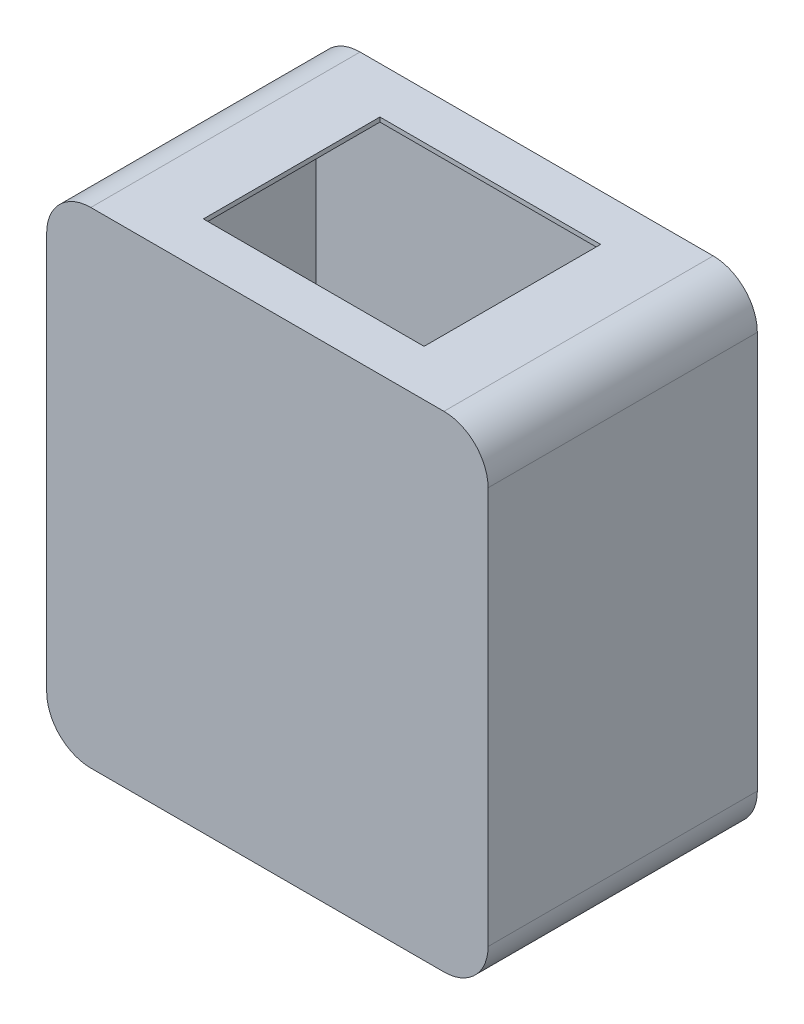
ISO-10303-21;
HEADER;
FILE_DESCRIPTION(('STEP AP214'),'2;1');
FILE_NAME('part.step','',(''),(''),'','','');
FILE_SCHEMA(('AUTOMOTIVE_DESIGN { 1 0 10303 214 1 1 1 1 }'));
ENDSEC;
DATA;
#1=APPLICATION_CONTEXT('core data for automotive mechanical design processes');
#2=APPLICATION_PROTOCOL_DEFINITION('international standard','automotive_design',2000,#1);
#3=PRODUCT_CONTEXT('',#1,'mechanical');
#4=PRODUCT('Part','Part','',(#3));
#5=PRODUCT_RELATED_PRODUCT_CATEGORY('part','',(#4));
#6=PRODUCT_DEFINITION_FORMATION('','',#4);
#7=PRODUCT_DEFINITION_CONTEXT('part definition',#1,'design');
#8=PRODUCT_DEFINITION('design','',#6,#7);
#9=PRODUCT_DEFINITION_SHAPE('','',#8);
#10=(LENGTH_UNIT() NAMED_UNIT(*) SI_UNIT(.MILLI.,.METRE.));
#11=(NAMED_UNIT(*) PLANE_ANGLE_UNIT() SI_UNIT($,.RADIAN.));
#12=(NAMED_UNIT(*) SI_UNIT($,.STERADIAN.) SOLID_ANGLE_UNIT());
#13=UNCERTAINTY_MEASURE_WITH_UNIT(LENGTH_MEASURE(1.E-05),#10,'distance_accuracy_value','');
#14=(GEOMETRIC_REPRESENTATION_CONTEXT(3) GLOBAL_UNCERTAINTY_ASSIGNED_CONTEXT((#13)) GLOBAL_UNIT_ASSIGNED_CONTEXT((#10,
#11,#12)) REPRESENTATION_CONTEXT('',''));
#15=CARTESIAN_POINT('',(0.,0.,0.));
#16=DIRECTION('',(0.,0.,1.));
#17=DIRECTION('',(1.,0.,0.));
#18=AXIS2_PLACEMENT_3D('',#15,#16,#17);
#19=CARTESIAN_POINT('',(-18.6152339310117,-88.0712894620894,0.));
#20=DIRECTION('',(0.,0.,-1.));
#21=DIRECTION('',(-1.,0.,0.));
#22=AXIS2_PLACEMENT_3D('',#19,#20,#21);
#23=CYLINDRICAL_SURFACE('',#22,3.175);
#24=CARTESIAN_POINT('',(-18.6152339310117,-88.0712894620894,0.));
#25=DIRECTION('',(0.,0.,-1.));
#26=DIRECTION('',(-1.,0.,0.));
#27=AXIS2_PLACEMENT_3D('',#24,#25,#26);
#28=CIRCLE('',#27,3.175);
#29=CARTESIAN_POINT('',(-21.7902339310117,-88.0712894620894,0.));
#30=VERTEX_POINT('',#29);
#31=EDGE_CURVE('E11',#30,#30,#28,.T.);
#32=ORIENTED_EDGE('',*,*,#31,.T.);
#33=EDGE_LOOP('',(#32));
#34=FACE_BOUND('',#33,.T.);
#35=CARTESIAN_POINT('',(-18.6152339310117,-88.0712894620894,-14.7));
#36=DIRECTION('',(0.,0.,-1.));
#37=DIRECTION('',(-1.,0.,0.));
#38=AXIS2_PLACEMENT_3D('',#35,#36,#37);
#39=CIRCLE('',#38,3.175);
#40=CARTESIAN_POINT('',(-21.7902339310117,-88.0712894620894,-14.7));
#41=VERTEX_POINT('',#40);
#42=EDGE_CURVE('E57',#41,#41,#39,.T.);
#43=ORIENTED_EDGE('',*,*,#42,.F.);
#44=EDGE_LOOP('',(#43));
#45=FACE_BOUND('',#44,.T.);
#46=ADVANCED_FACE('F47',(#34,#45),#23,.T.);
#47=CARTESIAN_POINT('',(-18.6152339310117,-88.0712894620894,0.));
#48=DIRECTION('',(0.,0.,-1.));
#49=DIRECTION('',(-1.,0.,0.));
#50=AXIS2_PLACEMENT_3D('',#47,#48,#49);
#51=PLANE('',#50);
#52=CARTESIAN_POINT('',(-18.6152339310117,-88.0712894620894,0.));
#53=DIRECTION('',(0.,0.,-1.));
#54=DIRECTION('',(-1.,0.,0.));
#55=AXIS2_PLACEMENT_3D('',#52,#53,#54);
#56=CIRCLE('',#55,1.905);
#57=CARTESIAN_POINT('',(-20.5202339310118,-88.0712894620894,0.));
#58=VERTEX_POINT('',#57);
#59=EDGE_CURVE('E53',#58,#58,#56,.T.);
#60=ORIENTED_EDGE('',*,*,#59,.T.);
#61=EDGE_LOOP('',(#60));
#62=FACE_BOUND('',#61,.T.);
#63=ORIENTED_EDGE('',*,*,#31,.F.);
#64=EDGE_LOOP('',(#63));
#65=FACE_BOUND('',#64,.T.);
#66=ADVANCED_FACE('F76',(#62,#65),#51,.F.);
#67=CARTESIAN_POINT('',(-18.6152339310117,-88.0712894620894,0.));
#68=DIRECTION('',(0.,0.,-1.));
#69=DIRECTION('',(-1.,0.,0.));
#70=AXIS2_PLACEMENT_3D('',#67,#68,#69);
#71=CYLINDRICAL_SURFACE('',#70,1.905);
#72=ORIENTED_EDGE('',*,*,#59,.F.);
#73=EDGE_LOOP('',(#72));
#74=FACE_BOUND('',#73,.T.);
#75=CARTESIAN_POINT('',(-18.6152339310117,-88.0712894620894,-14.7));
#76=DIRECTION('',(0.,0.,-1.));
#77=DIRECTION('',(-1.,0.,0.));
#78=AXIS2_PLACEMENT_3D('',#75,#76,#77);
#79=CIRCLE('',#78,1.905);
#80=CARTESIAN_POINT('',(-20.5202339310118,-88.0712894620894,-14.7));
#81=VERTEX_POINT('',#80);
#82=EDGE_CURVE('E61',#81,#81,#79,.T.);
#83=ORIENTED_EDGE('',*,*,#82,.T.);
#84=EDGE_LOOP('',(#83));
#85=FACE_BOUND('',#84,.T.);
#86=ADVANCED_FACE('F67',(#74,#85),#71,.F.);
#87=CARTESIAN_POINT('',(-18.6152339310117,-88.0712894620894,-14.7));
#88=DIRECTION('',(0.,0.,-1.));
#89=DIRECTION('',(-1.,0.,0.));
#90=AXIS2_PLACEMENT_3D('',#87,#88,#89);
#91=PLANE('',#90);
#92=ORIENTED_EDGE('',*,*,#42,.T.);
#93=EDGE_LOOP('',(#92));
#94=FACE_BOUND('',#93,.T.);
#95=ORIENTED_EDGE('',*,*,#82,.F.);
#96=EDGE_LOOP('',(#95));
#97=FACE_BOUND('',#96,.T.);
#98=ADVANCED_FACE('F69',(#94,#97),#91,.T.);
#99=CLOSED_SHELL('',(#46,#66,#86,#98));
#100=MANIFOLD_SOLID_BREP('B2',#99);
#101=CARTESIAN_POINT('',(61.3847660689883,106.753710537911,0.));
#102=DIRECTION('',(0.,0.,-1.));
#103=DIRECTION('',(-1.,0.,0.));
#104=AXIS2_PLACEMENT_3D('',#101,#102,#103);
#105=PLANE('',#104);
#106=DIRECTION('',(0.998027452261327,-0.0627790134739671,0.));
#107=VECTOR('',#106,1.);
#108=CARTESIAN_POINT('',(-110.826280735725,-85.3201232395585,0.));
#109=LINE('',#108,#107);
#110=CARTESIAN_POINT('',(-110.826280735725,-85.3201232395585,0.));
#111=VERTEX_POINT('',#110);
#112=CARTESIAN_POINT('',(-19.7098608255554,-91.0516278592755,0.));
#113=VERTEX_POINT('',#112);
#114=EDGE_CURVE('E408',#111,#113,#109,.T.);
#115=ORIENTED_EDGE('',*,*,#114,.T.);
#116=CARTESIAN_POINT('',(-18.6152339310117,-88.0712894620894,0.));
#117=DIRECTION('',(0.,0.,-1.));
#118=DIRECTION('',(-1.,0.,0.));
#119=AXIS2_PLACEMENT_3D('',#116,#117,#118);
#120=CIRCLE('',#119,3.175);
#121=CARTESIAN_POINT('',(-17.90270260418,-91.1653037006286,0.));
#122=VERTEX_POINT('',#121);
#123=EDGE_CURVE('E312',#113,#122,#120,.T.);
#124=ORIENTED_EDGE('',*,*,#123,.T.);
#125=CARTESIAN_POINT('',(-16.6152339310117,-91.2462894620894,0.));
#126=VERTEX_POINT('',#125);
#127=EDGE_CURVE('E407',#122,#126,#109,.T.);
#128=ORIENTED_EDGE('',*,*,#127,.T.);
#129=DIRECTION('',(0.99694994774744,0.078043588374547,0.));
#130=VECTOR('',#129,1.);
#131=CARTESIAN_POINT('',(-16.6152339310117,-91.2462894620894,0.));
#132=LINE('',#131,#130);
#133=CARTESIAN_POINT('',(75.0695165549904,-84.0689914008178,0.));
#134=VERTEX_POINT('',#133);
#135=EDGE_CURVE('E412',#126,#134,#132,.T.);
#136=ORIENTED_EDGE('',*,*,#135,.T.);
#137=CARTESIAN_POINT('',(59.3936463355146,-71.6485609387866,0.));
#138=DIRECTION('',(0.,0.,1.));
#139=DIRECTION('',(1.,0.,0.));
#140=AXIS2_PLACEMENT_3D('',#137,#138,#139);
#141=CIRCLE('',#140,20.);
#142=CARTESIAN_POINT('',(79.3847660689883,-71.0526315789474,0.));
#143=VERTEX_POINT('',#142);
#144=EDGE_CURVE('E379',#134,#143,#141,.T.);
#145=ORIENTED_EDGE('',*,*,#144,.T.);
#146=DIRECTION('',(0.,1.,0.));
#147=VECTOR('',#146,1.);
#148=CARTESIAN_POINT('',(79.3847660689883,108.947368421053,0.));
#149=LINE('',#148,#147);
#150=CARTESIAN_POINT('',(79.3847660689883,108.947368421053,0.));
#151=VERTEX_POINT('',#150);
#152=EDGE_CURVE('E383',#143,#151,#149,.T.);
#153=ORIENTED_EDGE('',*,*,#152,.T.);
#154=CARTESIAN_POINT('',(59.7613192905174,105.084683275649,0.));
#155=DIRECTION('',(0.,0.,1.));
#156=DIRECTION('',(-1.,0.,0.));
#157=AXIS2_PLACEMENT_3D('',#154,#155,#156);
#158=CIRCLE('',#157,20.);
#159=CARTESIAN_POINT('',(63.3847660689883,124.753710537911,0.));
#160=VERTEX_POINT('',#159);
#161=EDGE_CURVE('E387',#151,#160,#158,.T.);
#162=ORIENTED_EDGE('',*,*,#161,.T.);
#163=DIRECTION('',(-1.,0.,0.));
#164=VECTOR('',#163,1.);
#165=CARTESIAN_POINT('',(-96.6152339310117,124.753710537911,0.));
#166=LINE('',#165,#164);
#167=CARTESIAN_POINT('',(-96.6152339310117,124.753710537911,0.));
#168=VERTEX_POINT('',#167);
#169=EDGE_CURVE('E391',#160,#168,#166,.T.);
#170=ORIENTED_EDGE('',*,*,#169,.T.);
#171=CARTESIAN_POINT('',(-96.6152339310117,104.753710537911,0.));
#172=DIRECTION('',(0.,0.,1.));
#173=DIRECTION('',(1.,0.,0.));
#174=AXIS2_PLACEMENT_3D('',#171,#172,#173);
#175=CIRCLE('',#174,20.);
#176=CARTESIAN_POINT('',(-116.615233931012,104.753710537911,0.));
#177=VERTEX_POINT('',#176);
#178=EDGE_CURVE('E395',#168,#177,#175,.T.);
#179=ORIENTED_EDGE('',*,*,#178,.T.);
#180=DIRECTION('',(0.,-1.,0.));
#181=VECTOR('',#180,1.);
#182=CARTESIAN_POINT('',(-116.615233931012,104.753710537911,0.));
#183=LINE('',#182,#181);
#184=CARTESIAN_POINT('',(-116.615233931012,-71.0526315789475,0.));
#185=VERTEX_POINT('',#184);
#186=EDGE_CURVE('E399',#177,#185,#183,.T.);
#187=ORIENTED_EDGE('',*,*,#186,.T.);
#188=CARTESIAN_POINT('',(-96.6161715375948,-71.2462894840671,0.));
#189=DIRECTION('',(0.,0.,1.));
#190=DIRECTION('',(-1.,0.,0.));
#191=AXIS2_PLACEMENT_3D('',#188,#189,#190);
#192=CIRCLE('',#191,20.);
#193=EDGE_CURVE('E403',#185,#111,#192,.T.);
#194=ORIENTED_EDGE('',*,*,#193,.T.);
#195=EDGE_LOOP('',(#115,#124,#128,#136,#145,#153,#162,#170,#179,#187,#194));
#196=FACE_BOUND('',#195,.T.);
#197=ADVANCED_FACE('F108',(#196),#105,.F.);
#198=CARTESIAN_POINT('',(-16.6152339310117,-91.2462894620894,120.));
#199=DIRECTION('',(-0.078043588374547,0.99694994774744,0.));
#200=DIRECTION('',(-0.996949947747441,-0.078043588374547,0.));
#201=AXIS2_PLACEMENT_3D('',#198,#199,#200);
#202=PLANE('',#201);
#203=DIRECTION('',(0.,0.,-1.));
#204=VECTOR('',#203,1.);
#205=CARTESIAN_POINT('',(-16.6152339310117,-91.2462894620894,120.));
#206=LINE('',#205,#204);
#207=CARTESIAN_POINT('',(-16.6152339310117,-91.2462894620894,118.));
#208=VERTEX_POINT('',#207);
#209=EDGE_CURVE('E420',#208,#126,#206,.T.);
#210=ORIENTED_EDGE('',*,*,#209,.F.);
#211=DIRECTION('',(0.996949947747441,0.078043588374547,0.));
#212=VECTOR('',#211,1.);
#213=CARTESIAN_POINT('',(-16.6152339310117,-91.2462894620894,118.));
#214=LINE('',#213,#212);
#215=CARTESIAN_POINT('',(75.0695165549904,-84.0689914008178,118.));
#216=VERTEX_POINT('',#215);
#217=EDGE_CURVE('E45',#208,#216,#214,.T.);
#218=ORIENTED_EDGE('',*,*,#217,.T.);
#219=DIRECTION('',(0.,0.,-1.));
#220=VECTOR('',#219,1.);
#221=CARTESIAN_POINT('',(75.0695165549904,-84.0689914008178,120.));
#222=LINE('',#221,#220);
#223=EDGE_CURVE('E417',#216,#134,#222,.T.);
#224=ORIENTED_EDGE('',*,*,#223,.T.);
#225=ORIENTED_EDGE('',*,*,#135,.F.);
#226=EDGE_LOOP('',(#210,#218,#224,#225));
#227=FACE_BOUND('',#226,.T.);
#228=ADVANCED_FACE('F546',(#227),#202,.T.);
#229=CARTESIAN_POINT('',(-110.826280735725,-85.3201232395585,120.));
#230=DIRECTION('',(0.0627790134739671,0.998027452261327,0.));
#231=DIRECTION('',(-0.998027452261327,0.0627790134739671,0.));
#232=AXIS2_PLACEMENT_3D('',#229,#230,#231);
#233=PLANE('',#232);
#234=DIRECTION('',(0.,0.,-1.));
#235=VECTOR('',#234,1.);
#236=CARTESIAN_POINT('',(-110.826280735725,-85.3201232395585,120.));
#237=LINE('',#236,#235);
#238=CARTESIAN_POINT('',(-110.826280735725,-85.3201232395585,118.));
#239=VERTEX_POINT('',#238);
#240=EDGE_CURVE('E424',#239,#111,#237,.T.);
#241=ORIENTED_EDGE('',*,*,#240,.F.);
#242=DIRECTION('',(0.998027452261327,-0.0627790134739671,0.));
#243=VECTOR('',#242,1.);
#244=CARTESIAN_POINT('',(-110.826280735725,-85.3201232395585,118.));
#245=LINE('',#244,#243);
#246=EDGE_CURVE('E311',#239,#208,#245,.T.);
#247=ORIENTED_EDGE('',*,*,#246,.T.);
#248=ORIENTED_EDGE('',*,*,#209,.T.);
#249=ORIENTED_EDGE('',*,*,#127,.F.);
#250=EDGE_CURVE('E413',#113,#122,#109,.T.);
#251=ORIENTED_EDGE('',*,*,#250,.F.);
#252=ORIENTED_EDGE('',*,*,#114,.F.);
#253=EDGE_LOOP('',(#241,#247,#248,#249,#251,#252));
#254=FACE_BOUND('',#253,.T.);
#255=ADVANCED_FACE('F552',(#254),#233,.T.);
#256=CARTESIAN_POINT('',(-96.6161715375948,-71.2462894840671,120.));
#257=DIRECTION('',(0.,0.,-1.));
#258=DIRECTION('',(-1.,0.,0.));
#259=AXIS2_PLACEMENT_3D('',#256,#257,#258);
#260=CYLINDRICAL_SURFACE('',#259,20.);
#261=DIRECTION('',(0.,0.,-1.));
#262=VECTOR('',#261,1.);
#263=CARTESIAN_POINT('',(-116.615233931012,-71.0526315789475,120.));
#264=LINE('',#263,#262);
#265=CARTESIAN_POINT('',(-116.615233931012,-71.0526315789475,118.));
#266=VERTEX_POINT('',#265);
#267=EDGE_CURVE('E427',#266,#185,#264,.T.);
#268=ORIENTED_EDGE('',*,*,#267,.F.);
#269=CARTESIAN_POINT('',(-96.6161715375948,-71.2462894840671,118.));
#270=DIRECTION('',(0.,0.,1.));
#271=DIRECTION('',(1.,0.,0.));
#272=AXIS2_PLACEMENT_3D('',#269,#270,#271);
#273=CIRCLE('',#272,20.);
#274=EDGE_CURVE('E319',#266,#239,#273,.T.);
#275=ORIENTED_EDGE('',*,*,#274,.T.);
#276=ORIENTED_EDGE('',*,*,#240,.T.);
#277=ORIENTED_EDGE('',*,*,#193,.F.);
#278=EDGE_LOOP('',(#268,#275,#276,#277));
#279=FACE_BOUND('',#278,.T.);
#280=ADVANCED_FACE('F560',(#279),#260,.F.);
#281=CARTESIAN_POINT('',(-116.615233931012,104.753710537911,120.));
#282=DIRECTION('',(1.,0.,0.));
#283=DIRECTION('',(0.,1.,0.));
#284=AXIS2_PLACEMENT_3D('',#281,#282,#283);
#285=PLANE('',#284);
#286=DIRECTION('',(0.,0.,-1.));
#287=VECTOR('',#286,1.);
#288=CARTESIAN_POINT('',(-116.615233931012,104.753710537911,120.));
#289=LINE('',#288,#287);
#290=CARTESIAN_POINT('',(-116.615233931012,104.753710537911,118.));
#291=VERTEX_POINT('',#290);
#292=EDGE_CURVE('E430',#291,#177,#289,.T.);
#293=ORIENTED_EDGE('',*,*,#292,.F.);
#294=DIRECTION('',(0.,-1.,0.));
#295=VECTOR('',#294,1.);
#296=CARTESIAN_POINT('',(-116.615233931012,104.753710537911,118.));
#297=LINE('',#296,#295);
#298=EDGE_CURVE('E323',#291,#266,#297,.T.);
#299=ORIENTED_EDGE('',*,*,#298,.T.);
#300=ORIENTED_EDGE('',*,*,#267,.T.);
#301=ORIENTED_EDGE('',*,*,#186,.F.);
#302=EDGE_LOOP('',(#293,#299,#300,#301));
#303=FACE_BOUND('',#302,.T.);
#304=ADVANCED_FACE('F564',(#303),#285,.T.);
#305=CARTESIAN_POINT('',(-96.6152339310117,104.753710537911,120.));
#306=DIRECTION('',(0.,0.,-1.));
#307=DIRECTION('',(-1.,0.,0.));
#308=AXIS2_PLACEMENT_3D('',#305,#306,#307);
#309=CYLINDRICAL_SURFACE('',#308,20.);
#310=DIRECTION('',(0.,0.,-1.));
#311=VECTOR('',#310,1.);
#312=CARTESIAN_POINT('',(-96.6152339310117,124.753710537911,120.));
#313=LINE('',#312,#311);
#314=CARTESIAN_POINT('',(-96.6152339310117,124.753710537911,118.));
#315=VERTEX_POINT('',#314);
#316=EDGE_CURVE('E433',#315,#168,#313,.T.);
#317=ORIENTED_EDGE('',*,*,#316,.F.);
#318=CARTESIAN_POINT('',(-96.6152339310117,104.753710537911,118.));
#319=DIRECTION('',(0.,0.,1.));
#320=DIRECTION('',(1.,0.,0.));
#321=AXIS2_PLACEMENT_3D('',#318,#319,#320);
#322=CIRCLE('',#321,20.);
#323=EDGE_CURVE('E327',#315,#291,#322,.T.);
#324=ORIENTED_EDGE('',*,*,#323,.T.);
#325=ORIENTED_EDGE('',*,*,#292,.T.);
#326=ORIENTED_EDGE('',*,*,#178,.F.);
#327=EDGE_LOOP('',(#317,#324,#325,#326));
#328=FACE_BOUND('',#327,.T.);
#329=ADVANCED_FACE('F568',(#328),#309,.F.);
#330=CARTESIAN_POINT('',(-96.6152339310117,124.753710537911,120.));
#331=DIRECTION('',(0.,-1.,0.));
#332=DIRECTION('',(1.,0.,0.));
#333=AXIS2_PLACEMENT_3D('',#330,#331,#332);
#334=PLANE('',#333);
#335=DIRECTION('',(0.,0.,-1.));
#336=VECTOR('',#335,1.);
#337=CARTESIAN_POINT('',(31.3847660689882,124.753710537911,19.));
#338=LINE('',#337,#336);
#339=CARTESIAN_POINT('',(31.3847660689883,124.753710537911,99.));
#340=VERTEX_POINT('',#339);
#341=CARTESIAN_POINT('',(31.3847660689882,124.753710537911,19.));
#342=VERTEX_POINT('',#341);
#343=EDGE_CURVE('E260',#340,#342,#338,.T.);
#344=ORIENTED_EDGE('',*,*,#343,.T.);
#345=DIRECTION('',(-1.,0.,0.));
#346=VECTOR('',#345,1.);
#347=CARTESIAN_POINT('',(-68.6152339310118,124.753710537911,19.));
#348=LINE('',#347,#346);
#349=CARTESIAN_POINT('',(-68.6152339310118,124.753710537911,19.));
#350=VERTEX_POINT('',#349);
#351=EDGE_CURVE('E270',#342,#350,#348,.T.);
#352=ORIENTED_EDGE('',*,*,#351,.T.);
#353=DIRECTION('',(0.,0.,1.));
#354=VECTOR('',#353,1.);
#355=CARTESIAN_POINT('',(-68.6152339310118,124.753710537911,19.));
#356=LINE('',#355,#354);
#357=CARTESIAN_POINT('',(-68.6152339310118,124.753710537911,99.));
#358=VERTEX_POINT('',#357);
#359=EDGE_CURVE('E124',#350,#358,#356,.T.);
#360=ORIENTED_EDGE('',*,*,#359,.T.);
#361=DIRECTION('',(1.,0.,0.));
#362=VECTOR('',#361,1.);
#363=CARTESIAN_POINT('',(-68.6152339310118,124.753710537911,99.));
#364=LINE('',#363,#362);
#365=EDGE_CURVE('E267',#358,#340,#364,.T.);
#366=ORIENTED_EDGE('',*,*,#365,.T.);
#367=EDGE_LOOP('',(#344,#352,#360,#366));
#368=FACE_BOUND('',#367,.T.);
#369=DIRECTION('',(0.,0.,-1.));
#370=VECTOR('',#369,1.);
#371=CARTESIAN_POINT('',(63.3847660689883,124.753710537911,120.));
#372=LINE('',#371,#370);
#373=CARTESIAN_POINT('',(63.3847660689883,124.753710537911,118.));
#374=VERTEX_POINT('',#373);
#375=EDGE_CURVE('E436',#374,#160,#372,.T.);
#376=ORIENTED_EDGE('',*,*,#375,.F.);
#377=DIRECTION('',(-1.,0.,0.));
#378=VECTOR('',#377,1.);
#379=CARTESIAN_POINT('',(-96.6152339310117,124.753710537911,118.));
#380=LINE('',#379,#378);
#381=EDGE_CURVE('E331',#374,#315,#380,.T.);
#382=ORIENTED_EDGE('',*,*,#381,.T.);
#383=ORIENTED_EDGE('',*,*,#316,.T.);
#384=ORIENTED_EDGE('',*,*,#169,.F.);
#385=EDGE_LOOP('',(#376,#382,#383,#384));
#386=FACE_BOUND('',#385,.T.);
#387=ADVANCED_FACE('F275',(#368,#386),#334,.T.);
#388=CARTESIAN_POINT('',(59.7613192905174,105.084683275649,120.));
#389=DIRECTION('',(0.,0.,-1.));
#390=DIRECTION('',(-1.,0.,0.));
#391=AXIS2_PLACEMENT_3D('',#388,#389,#390);
#392=CYLINDRICAL_SURFACE('',#391,20.);
#393=DIRECTION('',(0.,0.,-1.));
#394=VECTOR('',#393,1.);
#395=CARTESIAN_POINT('',(79.3847660689883,108.947368421053,120.));
#396=LINE('',#395,#394);
#397=CARTESIAN_POINT('',(79.3847660689883,108.947368421053,118.));
#398=VERTEX_POINT('',#397);
#399=EDGE_CURVE('E439',#398,#151,#396,.T.);
#400=ORIENTED_EDGE('',*,*,#399,.F.);
#401=CARTESIAN_POINT('',(59.7613192905174,105.084683275649,118.));
#402=DIRECTION('',(0.,0.,1.));
#403=DIRECTION('',(1.,0.,0.));
#404=AXIS2_PLACEMENT_3D('',#401,#402,#403);
#405=CIRCLE('',#404,20.);
#406=EDGE_CURVE('E335',#398,#374,#405,.T.);
#407=ORIENTED_EDGE('',*,*,#406,.T.);
#408=ORIENTED_EDGE('',*,*,#375,.T.);
#409=ORIENTED_EDGE('',*,*,#161,.F.);
#410=EDGE_LOOP('',(#400,#407,#408,#409));
#411=FACE_BOUND('',#410,.T.);
#412=ADVANCED_FACE('F575',(#411),#392,.F.);
#413=CARTESIAN_POINT('',(79.3847660689883,108.947368421053,120.));
#414=DIRECTION('',(-1.,0.,0.));
#415=DIRECTION('',(0.,-1.,0.));
#416=AXIS2_PLACEMENT_3D('',#413,#414,#415);
#417=PLANE('',#416);
#418=DIRECTION('',(0.,0.,-1.));
#419=VECTOR('',#418,1.);
#420=CARTESIAN_POINT('',(79.3847660689883,-71.0526315789474,120.));
#421=LINE('',#420,#419);
#422=CARTESIAN_POINT('',(79.3847660689883,-71.0526315789474,118.));
#423=VERTEX_POINT('',#422);
#424=EDGE_CURVE('E442',#423,#143,#421,.T.);
#425=ORIENTED_EDGE('',*,*,#424,.F.);
#426=DIRECTION('',(0.,1.,0.));
#427=VECTOR('',#426,1.);
#428=CARTESIAN_POINT('',(79.3847660689883,108.947368421053,118.));
#429=LINE('',#428,#427);
#430=EDGE_CURVE('E339',#423,#398,#429,.T.);
#431=ORIENTED_EDGE('',*,*,#430,.T.);
#432=ORIENTED_EDGE('',*,*,#399,.T.);
#433=ORIENTED_EDGE('',*,*,#152,.F.);
#434=EDGE_LOOP('',(#425,#431,#432,#433));
#435=FACE_BOUND('',#434,.T.);
#436=ADVANCED_FACE('F578',(#435),#417,.T.);
#437=CARTESIAN_POINT('',(59.3936463355146,-71.6485609387866,120.));
#438=DIRECTION('',(0.,0.,-1.));
#439=DIRECTION('',(-1.,0.,0.));
#440=AXIS2_PLACEMENT_3D('',#437,#438,#439);
#441=CYLINDRICAL_SURFACE('',#440,20.);
#442=ORIENTED_EDGE('',*,*,#223,.F.);
#443=CARTESIAN_POINT('',(59.3936463355146,-71.6485609387866,118.));
#444=DIRECTION('',(0.,0.,1.));
#445=DIRECTION('',(1.,0.,0.));
#446=AXIS2_PLACEMENT_3D('',#443,#444,#445);
#447=CIRCLE('',#446,20.);
#448=EDGE_CURVE('E343',#216,#423,#447,.T.);
#449=ORIENTED_EDGE('',*,*,#448,.T.);
#450=ORIENTED_EDGE('',*,*,#424,.T.);
#451=ORIENTED_EDGE('',*,*,#144,.F.);
#452=EDGE_LOOP('',(#442,#449,#450,#451));
#453=FACE_BOUND('',#452,.T.);
#454=ADVANCED_FACE('F581',(#453),#441,.F.);
#455=CARTESIAN_POINT('',(61.3847660689883,106.753710537911,118.));
#456=DIRECTION('',(0.,0.,1.));
#457=DIRECTION('',(-1.,0.,0.));
#458=AXIS2_PLACEMENT_3D('',#455,#456,#457);
#459=PLANE('',#458);
#460=ORIENTED_EDGE('',*,*,#448,.F.);
#461=ORIENTED_EDGE('',*,*,#217,.F.);
#462=ORIENTED_EDGE('',*,*,#246,.F.);
#463=ORIENTED_EDGE('',*,*,#274,.F.);
#464=ORIENTED_EDGE('',*,*,#298,.F.);
#465=ORIENTED_EDGE('',*,*,#323,.F.);
#466=ORIENTED_EDGE('',*,*,#381,.F.);
#467=ORIENTED_EDGE('',*,*,#406,.F.);
#468=ORIENTED_EDGE('',*,*,#430,.F.);
#469=EDGE_LOOP('',(#460,#461,#462,#463,#464,#465,#466,#467,#468));
#470=FACE_BOUND('',#469,.T.);
#471=ADVANCED_FACE('F584',(#470),#459,.F.);
#472=CARTESIAN_POINT('',(-18.6152339310117,-88.0712894620894,0.));
#473=DIRECTION('',(0.,0.,-1.));
#474=DIRECTION('',(-1.,0.,0.));
#475=AXIS2_PLACEMENT_3D('',#472,#473,#474);
#476=PLANE('',#475);
#477=ORIENTED_EDGE('',*,*,#250,.T.);
#478=EDGE_CURVE('E307',#122,#113,#120,.T.);
#479=ORIENTED_EDGE('',*,*,#478,.T.);
#480=EDGE_LOOP('',(#477,#479));
#481=FACE_BOUND('',#480,.T.);
#482=ADVANCED_FACE('F540',(#481),#476,.T.);
#483=CARTESIAN_POINT('',(-18.6152339310117,-88.0712894620894,0.));
#484=DIRECTION('',(0.,0.,-1.));
#485=DIRECTION('',(-1.,0.,0.));
#486=AXIS2_PLACEMENT_3D('',#483,#484,#485);
#487=CYLINDRICAL_SURFACE('',#486,3.175);
#488=ORIENTED_EDGE('',*,*,#478,.F.);
#489=ORIENTED_EDGE('',*,*,#123,.F.);
#490=EDGE_LOOP('',(#488,#489));
#491=FACE_BOUND('',#490,.T.);
#492=CARTESIAN_POINT('',(-18.6152339310117,-88.0712894620894,-2.));
#493=DIRECTION('',(0.,0.,-1.));
#494=DIRECTION('',(-1.,0.,0.));
#495=AXIS2_PLACEMENT_3D('',#492,#493,#494);
#496=CIRCLE('',#495,3.175);
#497=CARTESIAN_POINT('',(-21.7902339310117,-88.0712894620894,-2.));
#498=VERTEX_POINT('',#497);
#499=EDGE_CURVE('E301',#498,#498,#496,.T.);
#500=ORIENTED_EDGE('',*,*,#499,.T.);
#501=EDGE_LOOP('',(#500));
#502=FACE_BOUND('',#501,.T.);
#503=ADVANCED_FACE('F534',(#491,#502),#487,.F.);
#504=CARTESIAN_POINT('',(61.3847660689883,-73.2462894620894,120.));
#505=DIRECTION('',(0.,0.,1.));
#506=DIRECTION('',(1.,0.,0.));
#507=AXIS2_PLACEMENT_3D('',#504,#505,#506);
#508=PLANE('',#507);
#509=CARTESIAN_POINT('',(61.3847660689883,-73.2462894620894,120.));
#510=DIRECTION('',(0.,0.,1.));
#511=DIRECTION('',(1.,0.,0.));
#512=AXIS2_PLACEMENT_3D('',#509,#510,#511);
#513=CIRCLE('',#512,20.);
#514=CARTESIAN_POINT('',(61.3847660689882,-93.2462894620894,120.));
#515=VERTEX_POINT('',#514);
#516=CARTESIAN_POINT('',(81.3847660689883,-73.2462894620894,120.));
#517=VERTEX_POINT('',#516);
#518=EDGE_CURVE('E445',#515,#517,#513,.T.);
#519=ORIENTED_EDGE('',*,*,#518,.T.);
#520=DIRECTION('',(0.,1.,0.));
#521=VECTOR('',#520,1.);
#522=CARTESIAN_POINT('',(81.3847660689882,106.753710537911,120.));
#523=LINE('',#522,#521);
#524=CARTESIAN_POINT('',(81.3847660689882,106.753710537911,120.));
#525=VERTEX_POINT('',#524);
#526=EDGE_CURVE('E449',#517,#525,#523,.T.);
#527=ORIENTED_EDGE('',*,*,#526,.T.);
#528=CARTESIAN_POINT('',(61.3847660689883,106.753710537911,120.));
#529=DIRECTION('',(0.,0.,1.));
#530=DIRECTION('',(-1.,0.,0.));
#531=AXIS2_PLACEMENT_3D('',#528,#529,#530);
#532=CIRCLE('',#531,20.);
#533=CARTESIAN_POINT('',(61.3847660689882,126.753710537911,120.));
#534=VERTEX_POINT('',#533);
#535=EDGE_CURVE('E452',#525,#534,#532,.T.);
#536=ORIENTED_EDGE('',*,*,#535,.T.);
#537=DIRECTION('',(-1.,0.,0.));
#538=VECTOR('',#537,1.);
#539=CARTESIAN_POINT('',(-98.6152339310117,126.753710537911,120.));
#540=LINE('',#539,#538);
#541=CARTESIAN_POINT('',(-98.6152339310117,126.753710537911,120.));
#542=VERTEX_POINT('',#541);
#543=EDGE_CURVE('E455',#534,#542,#540,.T.);
#544=ORIENTED_EDGE('',*,*,#543,.T.);
#545=CARTESIAN_POINT('',(-98.6152339310117,106.753710537911,120.));
#546=DIRECTION('',(0.,0.,1.));
#547=DIRECTION('',(1.,0.,0.));
#548=AXIS2_PLACEMENT_3D('',#545,#546,#547);
#549=CIRCLE('',#548,20.);
#550=CARTESIAN_POINT('',(-118.615233931012,106.753710537911,120.));
#551=VERTEX_POINT('',#550);
#552=EDGE_CURVE('E458',#542,#551,#549,.T.);
#553=ORIENTED_EDGE('',*,*,#552,.T.);
#554=DIRECTION('',(0.,-1.,0.));
#555=VECTOR('',#554,1.);
#556=CARTESIAN_POINT('',(-118.615233931012,106.753710537911,120.));
#557=LINE('',#556,#555);
#558=CARTESIAN_POINT('',(-118.615233931012,-73.2462894620894,120.));
#559=VERTEX_POINT('',#558);
#560=EDGE_CURVE('E461',#551,#559,#557,.T.);
#561=ORIENTED_EDGE('',*,*,#560,.T.);
#562=CARTESIAN_POINT('',(-98.6152339310117,-73.2462894620894,120.));
#563=DIRECTION('',(0.,0.,1.));
#564=DIRECTION('',(-1.,0.,0.));
#565=AXIS2_PLACEMENT_3D('',#562,#563,#564);
#566=CIRCLE('',#565,20.);
#567=CARTESIAN_POINT('',(-98.6152339310117,-93.2462894620894,120.));
#568=VERTEX_POINT('',#567);
#569=EDGE_CURVE('E464',#559,#568,#566,.T.);
#570=ORIENTED_EDGE('',*,*,#569,.T.);
#571=DIRECTION('',(1.,0.,0.));
#572=VECTOR('',#571,1.);
#573=CARTESIAN_POINT('',(-98.6152339310117,-93.2462894620894,120.));
#574=LINE('',#573,#572);
#575=EDGE_CURVE('E467',#568,#515,#574,.T.);
#576=ORIENTED_EDGE('',*,*,#575,.T.);
#577=EDGE_LOOP('',(#519,#527,#536,#544,#553,#561,#570,#576));
#578=FACE_BOUND('',#577,.T.);
#579=ADVANCED_FACE('F532',(#578),#508,.T.);
#580=CARTESIAN_POINT('',(61.3847660689883,-73.2462894620894,120.));
#581=DIRECTION('',(0.,0.,-1.));
#582=DIRECTION('',(-1.,0.,0.));
#583=AXIS2_PLACEMENT_3D('',#580,#581,#582);
#584=CYLINDRICAL_SURFACE('',#583,20.);
#585=DIRECTION('',(0.,0.,-1.));
#586=VECTOR('',#585,1.);
#587=CARTESIAN_POINT('',(61.3847660689882,-93.2462894620894,120.));
#588=LINE('',#587,#586);
#589=CARTESIAN_POINT('',(61.3847660689882,-93.2462894620894,-2.));
#590=VERTEX_POINT('',#589);
#591=EDGE_CURVE('E470',#515,#590,#588,.T.);
#592=ORIENTED_EDGE('',*,*,#591,.T.);
#593=CARTESIAN_POINT('',(61.3847660689883,-73.2462894620894,-2.));
#594=DIRECTION('',(0.,0.,-1.));
#595=DIRECTION('',(-1.,0.,0.));
#596=AXIS2_PLACEMENT_3D('',#593,#594,#595);
#597=CIRCLE('',#596,20.);
#598=CARTESIAN_POINT('',(81.3847660689883,-73.2462894620894,-2.));
#599=VERTEX_POINT('',#598);
#600=EDGE_CURVE('E355',#599,#590,#597,.T.);
#601=ORIENTED_EDGE('',*,*,#600,.F.);
#602=DIRECTION('',(0.,0.,-1.));
#603=VECTOR('',#602,1.);
#604=CARTESIAN_POINT('',(81.3847660689883,-73.2462894620894,120.));
#605=LINE('',#604,#603);
#606=EDGE_CURVE('E117',#517,#599,#605,.T.);
#607=ORIENTED_EDGE('',*,*,#606,.F.);
#608=ORIENTED_EDGE('',*,*,#518,.F.);
#609=EDGE_LOOP('',(#592,#601,#607,#608));
#610=FACE_BOUND('',#609,.T.);
#611=ADVANCED_FACE('F110',(#610),#584,.T.);
#612=CARTESIAN_POINT('',(81.3847660689882,106.753710537911,120.));
#613=DIRECTION('',(-1.,0.,0.));
#614=DIRECTION('',(0.,-1.,0.));
#615=AXIS2_PLACEMENT_3D('',#612,#613,#614);
#616=PLANE('',#615);
#617=ORIENTED_EDGE('',*,*,#606,.T.);
#618=DIRECTION('',(0.,-1.,0.));
#619=VECTOR('',#618,1.);
#620=CARTESIAN_POINT('',(81.3847660689883,-73.2462894620894,-2.));
#621=LINE('',#620,#619);
#622=CARTESIAN_POINT('',(81.3847660689882,106.753710537911,-2.));
#623=VERTEX_POINT('',#622);
#624=EDGE_CURVE('E351',#623,#599,#621,.T.);
#625=ORIENTED_EDGE('',*,*,#624,.F.);
#626=DIRECTION('',(0.,0.,-1.));
#627=VECTOR('',#626,1.);
#628=CARTESIAN_POINT('',(81.3847660689882,106.753710537911,120.));
#629=LINE('',#628,#627);
#630=EDGE_CURVE('E488',#525,#623,#629,.T.);
#631=ORIENTED_EDGE('',*,*,#630,.F.);
#632=ORIENTED_EDGE('',*,*,#526,.F.);
#633=EDGE_LOOP('',(#617,#625,#631,#632));
#634=FACE_BOUND('',#633,.T.);
#635=ADVANCED_FACE('F494',(#634),#616,.F.);
#636=CARTESIAN_POINT('',(61.3847660689883,106.753710537911,120.));
#637=DIRECTION('',(0.,0.,-1.));
#638=DIRECTION('',(-1.,0.,0.));
#639=AXIS2_PLACEMENT_3D('',#636,#637,#638);
#640=CYLINDRICAL_SURFACE('',#639,20.);
#641=ORIENTED_EDGE('',*,*,#630,.T.);
#642=CARTESIAN_POINT('',(61.3847660689883,106.753710537911,-2.));
#643=DIRECTION('',(0.,0.,-1.));
#644=DIRECTION('',(-1.,0.,0.));
#645=AXIS2_PLACEMENT_3D('',#642,#643,#644);
#646=CIRCLE('',#645,20.);
#647=CARTESIAN_POINT('',(61.3847660689882,126.753710537911,-2.));
#648=VERTEX_POINT('',#647);
#649=EDGE_CURVE('E347',#648,#623,#646,.T.);
#650=ORIENTED_EDGE('',*,*,#649,.F.);
#651=DIRECTION('',(0.,0.,-1.));
#652=VECTOR('',#651,1.);
#653=CARTESIAN_POINT('',(61.3847660689882,126.753710537911,120.));
#654=LINE('',#653,#652);
#655=EDGE_CURVE('E485',#534,#648,#654,.T.);
#656=ORIENTED_EDGE('',*,*,#655,.F.);
#657=ORIENTED_EDGE('',*,*,#535,.F.);
#658=EDGE_LOOP('',(#641,#650,#656,#657));
#659=FACE_BOUND('',#658,.T.);
#660=ADVANCED_FACE('F529',(#659),#640,.T.);
#661=CARTESIAN_POINT('',(-98.6152339310117,126.753710537911,120.));
#662=DIRECTION('',(0.,-1.,0.));
#663=DIRECTION('',(0.,0.,-1.));
#664=AXIS2_PLACEMENT_3D('',#661,#662,#663);
#665=PLANE('',#664);
#666=DIRECTION('',(-1.,0.,0.));
#667=VECTOR('',#666,1.);
#668=CARTESIAN_POINT('',(-68.6152339310118,126.753710537911,19.));
#669=LINE('',#668,#667);
#670=CARTESIAN_POINT('',(31.3847660689882,126.753710537911,19.));
#671=VERTEX_POINT('',#670);
#672=CARTESIAN_POINT('',(-68.6152339310118,126.753710537911,19.));
#673=VERTEX_POINT('',#672);
#674=EDGE_CURVE('E292',#671,#673,#669,.T.);
#675=ORIENTED_EDGE('',*,*,#674,.F.);
#676=DIRECTION('',(0.,0.,-1.));
#677=VECTOR('',#676,1.);
#678=CARTESIAN_POINT('',(31.3847660689882,126.753710537911,19.));
#679=LINE('',#678,#677);
#680=CARTESIAN_POINT('',(31.3847660689883,126.753710537911,99.));
#681=VERTEX_POINT('',#680);
#682=EDGE_CURVE('E132',#681,#671,#679,.T.);
#683=ORIENTED_EDGE('',*,*,#682,.F.);
#684=DIRECTION('',(1.,0.,0.));
#685=VECTOR('',#684,1.);
#686=CARTESIAN_POINT('',(-68.6152339310118,126.753710537911,99.));
#687=LINE('',#686,#685);
#688=CARTESIAN_POINT('',(-68.6152339310118,126.753710537911,99.));
#689=VERTEX_POINT('',#688);
#690=EDGE_CURVE('E279',#689,#681,#687,.T.);
#691=ORIENTED_EDGE('',*,*,#690,.F.);
#692=DIRECTION('',(0.,0.,1.));
#693=VECTOR('',#692,1.);
#694=CARTESIAN_POINT('',(-68.6152339310118,126.753710537911,19.));
#695=LINE('',#694,#693);
#696=EDGE_CURVE('E283',#673,#689,#695,.T.);
#697=ORIENTED_EDGE('',*,*,#696,.F.);
#698=EDGE_LOOP('',(#675,#683,#691,#697));
#699=FACE_BOUND('',#698,.T.);
#700=ORIENTED_EDGE('',*,*,#655,.T.);
#701=DIRECTION('',(1.,0.,0.));
#702=VECTOR('',#701,1.);
#703=CARTESIAN_POINT('',(61.3847660689882,126.753710537911,-2.));
#704=LINE('',#703,#702);
#705=CARTESIAN_POINT('',(-98.6152339310117,126.753710537911,-2.));
#706=VERTEX_POINT('',#705);
#707=EDGE_CURVE('E375',#706,#648,#704,.T.);
#708=ORIENTED_EDGE('',*,*,#707,.F.);
#709=DIRECTION('',(0.,0.,-1.));
#710=VECTOR('',#709,1.);
#711=CARTESIAN_POINT('',(-98.6152339310117,126.753710537911,120.));
#712=LINE('',#711,#710);
#713=EDGE_CURVE('E482',#542,#706,#712,.T.);
#714=ORIENTED_EDGE('',*,*,#713,.F.);
#715=ORIENTED_EDGE('',*,*,#543,.F.);
#716=EDGE_LOOP('',(#700,#708,#714,#715));
#717=FACE_BOUND('',#716,.T.);
#718=ADVANCED_FACE('F526',(#699,#717),#665,.F.);
#719=CARTESIAN_POINT('',(-98.6152339310117,106.753710537911,120.));
#720=DIRECTION('',(0.,0.,-1.));
#721=DIRECTION('',(-1.,0.,0.));
#722=AXIS2_PLACEMENT_3D('',#719,#720,#721);
#723=CYLINDRICAL_SURFACE('',#722,20.);
#724=ORIENTED_EDGE('',*,*,#713,.T.);
#725=CARTESIAN_POINT('',(-98.6152339310117,106.753710537911,-2.));
#726=DIRECTION('',(0.,0.,-1.));
#727=DIRECTION('',(-1.,0.,0.));
#728=AXIS2_PLACEMENT_3D('',#725,#726,#727);
#729=CIRCLE('',#728,20.);
#730=CARTESIAN_POINT('',(-118.615233931012,106.753710537911,-2.));
#731=VERTEX_POINT('',#730);
#732=EDGE_CURVE('E371',#731,#706,#729,.T.);
#733=ORIENTED_EDGE('',*,*,#732,.F.);
#734=DIRECTION('',(0.,0.,-1.));
#735=VECTOR('',#734,1.);
#736=CARTESIAN_POINT('',(-118.615233931012,106.753710537911,120.));
#737=LINE('',#736,#735);
#738=EDGE_CURVE('E479',#551,#731,#737,.T.);
#739=ORIENTED_EDGE('',*,*,#738,.F.);
#740=ORIENTED_EDGE('',*,*,#552,.F.);
#741=EDGE_LOOP('',(#724,#733,#739,#740));
#742=FACE_BOUND('',#741,.T.);
#743=ADVANCED_FACE('F521',(#742),#723,.T.);
#744=CARTESIAN_POINT('',(-118.615233931012,106.753710537911,120.));
#745=DIRECTION('',(1.,0.,0.));
#746=DIRECTION('',(0.,0.,-1.));
#747=AXIS2_PLACEMENT_3D('',#744,#745,#746);
#748=PLANE('',#747);
#749=ORIENTED_EDGE('',*,*,#738,.T.);
#750=DIRECTION('',(0.,1.,0.));
#751=VECTOR('',#750,1.);
#752=CARTESIAN_POINT('',(-118.615233931012,106.753710537911,-2.));
#753=LINE('',#752,#751);
#754=CARTESIAN_POINT('',(-118.615233931012,-73.2462894620894,-2.));
#755=VERTEX_POINT('',#754);
#756=EDGE_CURVE('E367',#755,#731,#753,.T.);
#757=ORIENTED_EDGE('',*,*,#756,.F.);
#758=DIRECTION('',(0.,0.,-1.));
#759=VECTOR('',#758,1.);
#760=CARTESIAN_POINT('',(-118.615233931012,-73.2462894620894,120.));
#761=LINE('',#760,#759);
#762=EDGE_CURVE('E476',#559,#755,#761,.T.);
#763=ORIENTED_EDGE('',*,*,#762,.F.);
#764=ORIENTED_EDGE('',*,*,#560,.F.);
#765=EDGE_LOOP('',(#749,#757,#763,#764));
#766=FACE_BOUND('',#765,.T.);
#767=ADVANCED_FACE('F516',(#766),#748,.F.);
#768=CARTESIAN_POINT('',(-98.6152339310117,-73.2462894620894,120.));
#769=DIRECTION('',(0.,0.,-1.));
#770=DIRECTION('',(-1.,0.,0.));
#771=AXIS2_PLACEMENT_3D('',#768,#769,#770);
#772=CYLINDRICAL_SURFACE('',#771,20.);
#773=ORIENTED_EDGE('',*,*,#762,.T.);
#774=CARTESIAN_POINT('',(-98.6152339310117,-73.2462894620894,-2.));
#775=DIRECTION('',(0.,0.,-1.));
#776=DIRECTION('',(-1.,0.,0.));
#777=AXIS2_PLACEMENT_3D('',#774,#775,#776);
#778=CIRCLE('',#777,20.);
#779=CARTESIAN_POINT('',(-98.6152339310117,-93.2462894620894,-2.));
#780=VERTEX_POINT('',#779);
#781=EDGE_CURVE('E363',#780,#755,#778,.T.);
#782=ORIENTED_EDGE('',*,*,#781,.F.);
#783=DIRECTION('',(0.,0.,-1.));
#784=VECTOR('',#783,1.);
#785=CARTESIAN_POINT('',(-98.6152339310117,-93.2462894620894,120.));
#786=LINE('',#785,#784);
#787=EDGE_CURVE('E473',#568,#780,#786,.T.);
#788=ORIENTED_EDGE('',*,*,#787,.F.);
#789=ORIENTED_EDGE('',*,*,#569,.F.);
#790=EDGE_LOOP('',(#773,#782,#788,#789));
#791=FACE_BOUND('',#790,.T.);
#792=ADVANCED_FACE('F511',(#791),#772,.T.);
#793=CARTESIAN_POINT('',(-98.6152339310117,-93.2462894620894,120.));
#794=DIRECTION('',(0.,1.,0.));
#795=DIRECTION('',(0.,0.,1.));
#796=AXIS2_PLACEMENT_3D('',#793,#794,#795);
#797=PLANE('',#796);
#798=ORIENTED_EDGE('',*,*,#787,.T.);
#799=DIRECTION('',(-1.,0.,0.));
#800=VECTOR('',#799,1.);
#801=CARTESIAN_POINT('',(-98.6152339310117,-93.2462894620894,-2.));
#802=LINE('',#801,#800);
#803=EDGE_CURVE('E359',#590,#780,#802,.T.);
#804=ORIENTED_EDGE('',*,*,#803,.F.);
#805=ORIENTED_EDGE('',*,*,#591,.F.);
#806=ORIENTED_EDGE('',*,*,#575,.F.);
#807=EDGE_LOOP('',(#798,#804,#805,#806));
#808=FACE_BOUND('',#807,.T.);
#809=ADVANCED_FACE('F506',(#808),#797,.F.);
#810=CARTESIAN_POINT('',(61.3847660689883,106.753710537911,-2.));
#811=DIRECTION('',(0.,0.,-1.));
#812=DIRECTION('',(-1.,0.,0.));
#813=AXIS2_PLACEMENT_3D('',#810,#811,#812);
#814=PLANE('',#813);
#815=ORIENTED_EDGE('',*,*,#499,.F.);
#816=EDGE_LOOP('',(#815));
#817=FACE_BOUND('',#816,.T.);
#818=ORIENTED_EDGE('',*,*,#649,.T.);
#819=ORIENTED_EDGE('',*,*,#624,.T.);
#820=ORIENTED_EDGE('',*,*,#600,.T.);
#821=ORIENTED_EDGE('',*,*,#803,.T.);
#822=ORIENTED_EDGE('',*,*,#781,.T.);
#823=ORIENTED_EDGE('',*,*,#756,.T.);
#824=ORIENTED_EDGE('',*,*,#732,.T.);
#825=ORIENTED_EDGE('',*,*,#707,.T.);
#826=EDGE_LOOP('',(#818,#819,#820,#821,#822,#823,#824,#825));
#827=FACE_BOUND('',#826,.T.);
#828=ADVANCED_FACE('F500',(#817,#827),#814,.T.);
#829=CARTESIAN_POINT('',(31.3847660689882,124.753710537911,19.));
#830=DIRECTION('',(1.,0.,0.));
#831=DIRECTION('',(0.,0.,-1.));
#832=AXIS2_PLACEMENT_3D('',#829,#830,#831);
#833=PLANE('',#832);
#834=ORIENTED_EDGE('',*,*,#682,.T.);
#835=DIRECTION('',(0.,1.,0.));
#836=VECTOR('',#835,1.);
#837=CARTESIAN_POINT('',(31.3847660689882,124.753710537911,19.));
#838=LINE('',#837,#836);
#839=EDGE_CURVE('E256',#342,#671,#838,.T.);
#840=ORIENTED_EDGE('',*,*,#839,.F.);
#841=ORIENTED_EDGE('',*,*,#343,.F.);
#842=DIRECTION('',(0.,1.,0.));
#843=VECTOR('',#842,1.);
#844=CARTESIAN_POINT('',(31.3847660689883,124.753710537911,99.));
#845=LINE('',#844,#843);
#846=EDGE_CURVE('E298',#340,#681,#845,.T.);
#847=ORIENTED_EDGE('',*,*,#846,.T.);
#848=EDGE_LOOP('',(#834,#840,#841,#847));
#849=FACE_BOUND('',#848,.T.);
#850=ADVANCED_FACE('F258',(#849),#833,.F.);
#851=CARTESIAN_POINT('',(-68.6152339310118,124.753710537911,99.));
#852=DIRECTION('',(0.,0.,1.));
#853=DIRECTION('',(1.,0.,0.));
#854=AXIS2_PLACEMENT_3D('',#851,#852,#853);
#855=PLANE('',#854);
#856=ORIENTED_EDGE('',*,*,#690,.T.);
#857=ORIENTED_EDGE('',*,*,#846,.F.);
#858=ORIENTED_EDGE('',*,*,#365,.F.);
#859=DIRECTION('',(0.,1.,0.));
#860=VECTOR('',#859,1.);
#861=CARTESIAN_POINT('',(-68.6152339310118,124.753710537911,99.));
#862=LINE('',#861,#860);
#863=EDGE_CURVE('E302',#358,#689,#862,.T.);
#864=ORIENTED_EDGE('',*,*,#863,.T.);
#865=EDGE_LOOP('',(#856,#857,#858,#864));
#866=FACE_BOUND('',#865,.T.);
#867=ADVANCED_FACE('F624',(#866),#855,.F.);
#868=CARTESIAN_POINT('',(-68.6152339310118,124.753710537911,19.));
#869=DIRECTION('',(-1.,0.,0.));
#870=DIRECTION('',(0.,0.,1.));
#871=AXIS2_PLACEMENT_3D('',#868,#869,#870);
#872=PLANE('',#871);
#873=ORIENTED_EDGE('',*,*,#696,.T.);
#874=ORIENTED_EDGE('',*,*,#863,.F.);
#875=ORIENTED_EDGE('',*,*,#359,.F.);
#876=DIRECTION('',(0.,1.,0.));
#877=VECTOR('',#876,1.);
#878=CARTESIAN_POINT('',(-68.6152339310118,124.753710537911,19.));
#879=LINE('',#878,#877);
#880=EDGE_CURVE('E266',#350,#673,#879,.T.);
#881=ORIENTED_EDGE('',*,*,#880,.T.);
#882=EDGE_LOOP('',(#873,#874,#875,#881));
#883=FACE_BOUND('',#882,.T.);
#884=ADVANCED_FACE('F766',(#883),#872,.F.);
#885=CARTESIAN_POINT('',(-68.6152339310118,124.753710537911,19.));
#886=DIRECTION('',(0.,0.,-1.));
#887=DIRECTION('',(-1.,0.,0.));
#888=AXIS2_PLACEMENT_3D('',#885,#886,#887);
#889=PLANE('',#888);
#890=ORIENTED_EDGE('',*,*,#674,.T.);
#891=ORIENTED_EDGE('',*,*,#880,.F.);
#892=ORIENTED_EDGE('',*,*,#351,.F.);
#893=ORIENTED_EDGE('',*,*,#839,.T.);
#894=EDGE_LOOP('',(#890,#891,#892,#893));
#895=FACE_BOUND('',#894,.T.);
#896=ADVANCED_FACE('F271',(#895),#889,.F.);
#897=CLOSED_SHELL('',(#197,#228,#255,#280,#304,#329,#387,#412,#436,#454,#471,#482,#503,#579,
#611,#635,#660,#718,#743,#767,#792,#809,#828,#850,#867,#884,#896));
#898=MANIFOLD_SOLID_BREP('B6',#897);
#899=ADVANCED_BREP_SHAPE_REPRESENTATION('',(#18,#100,#898),#14);
#900=SHAPE_DEFINITION_REPRESENTATION(#9,#899);
ENDSEC;
END-ISO-10303-21;
